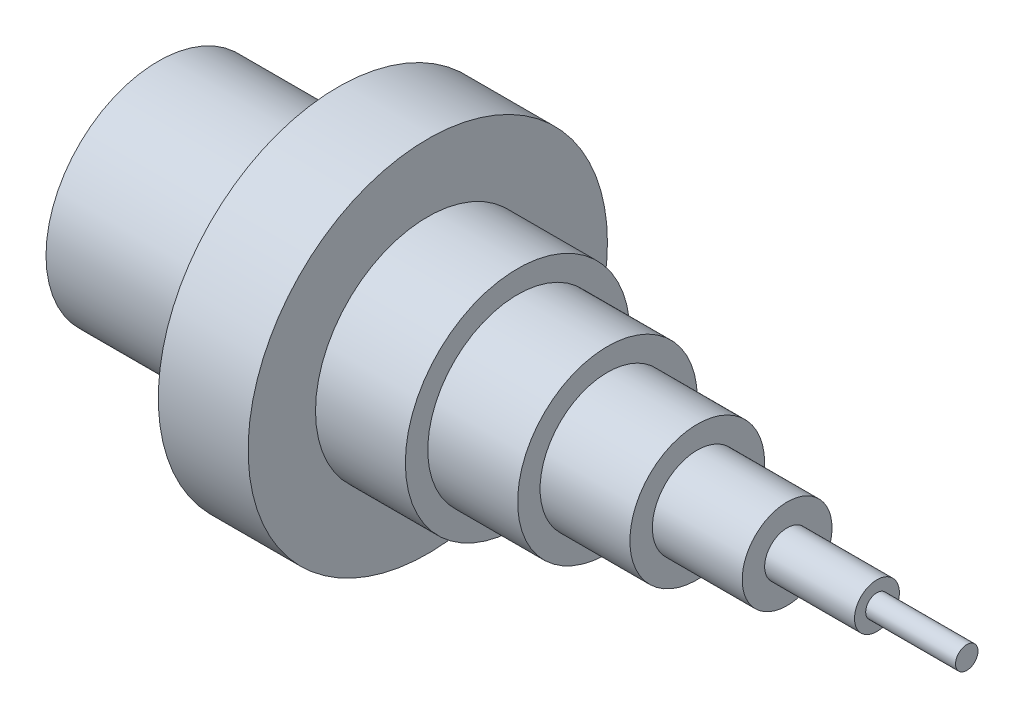
ISO-10303-21;
HEADER;
FILE_DESCRIPTION(('STEP AP214'),'2;1');
FILE_NAME('part.step','',(''),(''),'','','');
FILE_SCHEMA(('AUTOMOTIVE_DESIGN { 1 0 10303 214 1 1 1 1 }'));
ENDSEC;
DATA;
#1=APPLICATION_CONTEXT('core data for automotive mechanical design processes');
#2=APPLICATION_PROTOCOL_DEFINITION('international standard','automotive_design',2000,#1);
#3=PRODUCT_CONTEXT('',#1,'mechanical');
#4=PRODUCT('Part','Part','',(#3));
#5=PRODUCT_RELATED_PRODUCT_CATEGORY('part','',(#4));
#6=PRODUCT_DEFINITION_FORMATION('','',#4);
#7=PRODUCT_DEFINITION_CONTEXT('part definition',#1,'design');
#8=PRODUCT_DEFINITION('design','',#6,#7);
#9=PRODUCT_DEFINITION_SHAPE('','',#8);
#10=(LENGTH_UNIT() NAMED_UNIT(*) SI_UNIT(.MILLI.,.METRE.));
#11=(NAMED_UNIT(*) PLANE_ANGLE_UNIT() SI_UNIT($,.RADIAN.));
#12=(NAMED_UNIT(*) SI_UNIT($,.STERADIAN.) SOLID_ANGLE_UNIT());
#13=UNCERTAINTY_MEASURE_WITH_UNIT(LENGTH_MEASURE(1.E-05),#10,'distance_accuracy_value','');
#14=(GEOMETRIC_REPRESENTATION_CONTEXT(3) GLOBAL_UNCERTAINTY_ASSIGNED_CONTEXT((#13)) GLOBAL_UNIT_ASSIGNED_CONTEXT((#10,
#11,#12)) REPRESENTATION_CONTEXT('',''));
#15=CARTESIAN_POINT('',(0.,0.,0.));
#16=DIRECTION('',(0.,0.,1.));
#17=DIRECTION('',(1.,0.,0.));
#18=AXIS2_PLACEMENT_3D('',#15,#16,#17);
#19=CARTESIAN_POINT('',(180.,0.,0.));
#20=DIRECTION('',(-1.,0.,0.));
#21=DIRECTION('',(0.,0.,1.));
#22=AXIS2_PLACEMENT_3D('',#19,#20,#21);
#23=CYLINDRICAL_SURFACE('',#22,2.5);
#24=CARTESIAN_POINT('',(180.,0.,0.));
#25=DIRECTION('',(1.,0.,0.));
#26=DIRECTION('',(0.,0.,-1.));
#27=AXIS2_PLACEMENT_3D('',#24,#25,#26);
#28=CIRCLE('',#27,2.5);
#29=CARTESIAN_POINT('',(180.,0.,-2.5));
#30=VERTEX_POINT('',#29);
#31=EDGE_CURVE('E10',#30,#30,#28,.T.);
#32=ORIENTED_EDGE('',*,*,#31,.F.);
#33=EDGE_LOOP('',(#32));
#34=FACE_BOUND('',#33,.T.);
#35=CARTESIAN_POINT('',(160.,0.,0.));
#36=DIRECTION('',(1.,0.,0.));
#37=DIRECTION('',(0.,0.,-1.));
#38=AXIS2_PLACEMENT_3D('',#35,#36,#37);
#39=CIRCLE('',#38,2.5);
#40=CARTESIAN_POINT('',(160.,0.,-2.5));
#41=VERTEX_POINT('',#40);
#42=EDGE_CURVE('E33',#41,#41,#39,.T.);
#43=ORIENTED_EDGE('',*,*,#42,.T.);
#44=EDGE_LOOP('',(#43));
#45=FACE_BOUND('',#44,.T.);
#46=ADVANCED_FACE('F30',(#34,#45),#23,.T.);
#47=CARTESIAN_POINT('',(180.,0.,0.));
#48=DIRECTION('',(1.,0.,0.));
#49=DIRECTION('',(0.,0.,-1.));
#50=AXIS2_PLACEMENT_3D('',#47,#48,#49);
#51=PLANE('',#50);
#52=ORIENTED_EDGE('',*,*,#31,.T.);
#53=EDGE_LOOP('',(#52));
#54=FACE_BOUND('',#53,.T.);
#55=ADVANCED_FACE('F161',(#54),#51,.T.);
#56=CARTESIAN_POINT('',(160.,0.,0.));
#57=DIRECTION('',(-1.,0.,0.));
#58=DIRECTION('',(0.,0.,1.));
#59=AXIS2_PLACEMENT_3D('',#56,#57,#58);
#60=CYLINDRICAL_SURFACE('',#59,5.);
#61=CARTESIAN_POINT('',(160.,0.,0.));
#62=DIRECTION('',(1.,0.,0.));
#63=DIRECTION('',(0.,0.,-1.));
#64=AXIS2_PLACEMENT_3D('',#61,#62,#63);
#65=CIRCLE('',#64,5.);
#66=CARTESIAN_POINT('',(160.,0.,-5.));
#67=VERTEX_POINT('',#66);
#68=EDGE_CURVE('E40',#67,#67,#65,.T.);
#69=ORIENTED_EDGE('',*,*,#68,.F.);
#70=EDGE_LOOP('',(#69));
#71=FACE_BOUND('',#70,.T.);
#72=CARTESIAN_POINT('',(140.,0.,0.));
#73=DIRECTION('',(1.,0.,0.));
#74=DIRECTION('',(0.,0.,-1.));
#75=AXIS2_PLACEMENT_3D('',#72,#73,#74);
#76=CIRCLE('',#75,5.);
#77=CARTESIAN_POINT('',(140.,0.,-5.));
#78=VERTEX_POINT('',#77);
#79=EDGE_CURVE('E42',#78,#78,#76,.T.);
#80=ORIENTED_EDGE('',*,*,#79,.T.);
#81=EDGE_LOOP('',(#80));
#82=FACE_BOUND('',#81,.T.);
#83=ADVANCED_FACE('F166',(#71,#82),#60,.T.);
#84=CARTESIAN_POINT('',(160.,0.,0.));
#85=DIRECTION('',(1.,0.,0.));
#86=DIRECTION('',(0.,0.,-1.));
#87=AXIS2_PLACEMENT_3D('',#84,#85,#86);
#88=PLANE('',#87);
#89=ORIENTED_EDGE('',*,*,#42,.F.);
#90=EDGE_LOOP('',(#89));
#91=FACE_BOUND('',#90,.T.);
#92=ORIENTED_EDGE('',*,*,#68,.T.);
#93=EDGE_LOOP('',(#92));
#94=FACE_BOUND('',#93,.T.);
#95=ADVANCED_FACE('F170',(#91,#94),#88,.T.);
#96=CARTESIAN_POINT('',(40.,0.,0.));
#97=DIRECTION('',(-1.,0.,0.));
#98=DIRECTION('',(0.,0.,1.));
#99=AXIS2_PLACEMENT_3D('',#96,#97,#98);
#100=CYLINDRICAL_SURFACE('',#99,25.);
#101=CARTESIAN_POINT('',(40.,0.,0.));
#102=DIRECTION('',(1.,0.,0.));
#103=DIRECTION('',(0.,0.,-1.));
#104=AXIS2_PLACEMENT_3D('',#101,#102,#103);
#105=CIRCLE('',#104,25.);
#106=CARTESIAN_POINT('',(40.,0.,-25.));
#107=VERTEX_POINT('',#106);
#108=EDGE_CURVE('E51',#107,#107,#105,.T.);
#109=ORIENTED_EDGE('',*,*,#108,.F.);
#110=EDGE_LOOP('',(#109));
#111=FACE_BOUND('',#110,.T.);
#112=CARTESIAN_POINT('',(0.,0.,0.));
#113=DIRECTION('',(1.,0.,0.));
#114=DIRECTION('',(0.,0.,-1.));
#115=AXIS2_PLACEMENT_3D('',#112,#113,#114);
#116=CIRCLE('',#115,25.);
#117=CARTESIAN_POINT('',(0.,0.,-25.));
#118=VERTEX_POINT('',#117);
#119=EDGE_CURVE('E48',#118,#118,#116,.T.);
#120=ORIENTED_EDGE('',*,*,#119,.T.);
#121=EDGE_LOOP('',(#120));
#122=FACE_BOUND('',#121,.T.);
#123=ADVANCED_FACE('F173',(#111,#122),#100,.T.);
#124=CARTESIAN_POINT('',(0.,0.,0.));
#125=DIRECTION('',(1.,0.,0.));
#126=DIRECTION('',(0.,0.,-1.));
#127=AXIS2_PLACEMENT_3D('',#124,#125,#126);
#128=PLANE('',#127);
#129=CARTESIAN_POINT('',(0.,0.,0.));
#130=DIRECTION('',(1.,0.,0.));
#131=DIRECTION('',(0.,0.,-1.));
#132=AXIS2_PLACEMENT_3D('',#129,#130,#131);
#133=CIRCLE('',#132,20.);
#134=CARTESIAN_POINT('',(0.,0.,-20.));
#135=VERTEX_POINT('',#134);
#136=EDGE_CURVE('E58',#135,#135,#133,.T.);
#137=ORIENTED_EDGE('',*,*,#136,.T.);
#138=EDGE_LOOP('',(#137));
#139=FACE_BOUND('',#138,.T.);
#140=ORIENTED_EDGE('',*,*,#119,.F.);
#141=EDGE_LOOP('',(#140));
#142=FACE_BOUND('',#141,.T.);
#143=ADVANCED_FACE('F155',(#139,#142),#128,.F.);
#144=CARTESIAN_POINT('',(70.,0.,0.));
#145=DIRECTION('',(-1.,0.,0.));
#146=DIRECTION('',(0.,0.,1.));
#147=AXIS2_PLACEMENT_3D('',#144,#145,#146);
#148=CYLINDRICAL_SURFACE('',#147,20.);
#149=CARTESIAN_POINT('',(40.,0.,0.));
#150=DIRECTION('',(1.,0.,0.));
#151=DIRECTION('',(0.,0.,-1.));
#152=AXIS2_PLACEMENT_3D('',#149,#150,#151);
#153=CIRCLE('',#152,20.);
#154=CARTESIAN_POINT('',(40.,0.,-20.));
#155=VERTEX_POINT('',#154);
#156=EDGE_CURVE('E52',#155,#155,#153,.F.);
#157=ORIENTED_EDGE('',*,*,#156,.F.);
#158=EDGE_LOOP('',(#157));
#159=FACE_BOUND('',#158,.T.);
#160=ORIENTED_EDGE('',*,*,#136,.F.);
#161=EDGE_LOOP('',(#160));
#162=FACE_BOUND('',#161,.T.);
#163=ADVANCED_FACE('F149',(#159,#162),#148,.F.);
#164=CARTESIAN_POINT('',(40.,0.,0.));
#165=DIRECTION('',(1.,0.,0.));
#166=DIRECTION('',(0.,0.,-1.));
#167=AXIS2_PLACEMENT_3D('',#164,#165,#166);
#168=PLANE('',#167);
#169=ORIENTED_EDGE('',*,*,#108,.T.);
#170=EDGE_LOOP('',(#169));
#171=FACE_BOUND('',#170,.T.);
#172=CARTESIAN_POINT('',(40.,0.,0.));
#173=DIRECTION('',(1.,0.,0.));
#174=DIRECTION('',(0.,0.,-1.));
#175=AXIS2_PLACEMENT_3D('',#172,#173,#174);
#176=CIRCLE('',#175,40.);
#177=CARTESIAN_POINT('',(40.,0.,-40.));
#178=VERTEX_POINT('',#177);
#179=EDGE_CURVE('E62',#178,#178,#176,.T.);
#180=ORIENTED_EDGE('',*,*,#179,.F.);
#181=EDGE_LOOP('',(#180));
#182=FACE_BOUND('',#181,.T.);
#183=ADVANCED_FACE('F139',(#171,#182),#168,.F.);
#184=CARTESIAN_POINT('',(60.,0.,0.));
#185=DIRECTION('',(1.,0.,0.));
#186=DIRECTION('',(0.,0.,-1.));
#187=AXIS2_PLACEMENT_3D('',#184,#185,#186);
#188=PLANE('',#187);
#189=CARTESIAN_POINT('',(60.,0.,0.));
#190=DIRECTION('',(1.,0.,0.));
#191=DIRECTION('',(0.,0.,-1.));
#192=AXIS2_PLACEMENT_3D('',#189,#190,#191);
#193=CIRCLE('',#192,25.);
#194=CARTESIAN_POINT('',(60.,0.,-25.));
#195=VERTEX_POINT('',#194);
#196=EDGE_CURVE('E55',#195,#195,#193,.T.);
#197=ORIENTED_EDGE('',*,*,#196,.F.);
#198=EDGE_LOOP('',(#197));
#199=FACE_BOUND('',#198,.T.);
#200=CARTESIAN_POINT('',(60.,0.,0.));
#201=DIRECTION('',(1.,0.,0.));
#202=DIRECTION('',(0.,0.,-1.));
#203=AXIS2_PLACEMENT_3D('',#200,#201,#202);
#204=CIRCLE('',#203,40.);
#205=CARTESIAN_POINT('',(60.,0.,-40.));
#206=VERTEX_POINT('',#205);
#207=EDGE_CURVE('E61',#206,#206,#204,.T.);
#208=ORIENTED_EDGE('',*,*,#207,.T.);
#209=EDGE_LOOP('',(#208));
#210=FACE_BOUND('',#209,.T.);
#211=ADVANCED_FACE('F135',(#199,#210),#188,.T.);
#212=CARTESIAN_POINT('',(60.,0.,0.));
#213=DIRECTION('',(-1.,0.,0.));
#214=DIRECTION('',(0.,0.,1.));
#215=AXIS2_PLACEMENT_3D('',#212,#213,#214);
#216=CYLINDRICAL_SURFACE('',#215,40.);
#217=ORIENTED_EDGE('',*,*,#207,.F.);
#218=EDGE_LOOP('',(#217));
#219=FACE_BOUND('',#218,.T.);
#220=ORIENTED_EDGE('',*,*,#179,.T.);
#221=EDGE_LOOP('',(#220));
#222=FACE_BOUND('',#221,.T.);
#223=ADVANCED_FACE('F138',(#219,#222),#216,.T.);
#224=ORIENTED_EDGE('',*,*,#156,.T.);
#225=EDGE_LOOP('',(#224));
#226=FACE_BOUND('',#225,.T.);
#227=ADVANCED_FACE('F131',(#226),#168,.F.);
#228=CARTESIAN_POINT('',(80.,0.,0.));
#229=DIRECTION('',(-1.,0.,0.));
#230=DIRECTION('',(0.,0.,1.));
#231=AXIS2_PLACEMENT_3D('',#228,#229,#230);
#232=CYLINDRICAL_SURFACE('',#231,25.);
#233=CARTESIAN_POINT('',(80.,0.,0.));
#234=DIRECTION('',(1.,0.,0.));
#235=DIRECTION('',(0.,0.,-1.));
#236=AXIS2_PLACEMENT_3D('',#233,#234,#235);
#237=CIRCLE('',#236,25.);
#238=CARTESIAN_POINT('',(80.,0.,-25.));
#239=VERTEX_POINT('',#238);
#240=EDGE_CURVE('E65',#239,#239,#237,.T.);
#241=ORIENTED_EDGE('',*,*,#240,.F.);
#242=EDGE_LOOP('',(#241));
#243=FACE_BOUND('',#242,.T.);
#244=ORIENTED_EDGE('',*,*,#196,.T.);
#245=EDGE_LOOP('',(#244));
#246=FACE_BOUND('',#245,.T.);
#247=ADVANCED_FACE('F125',(#243,#246),#232,.T.);
#248=CARTESIAN_POINT('',(80.,0.,0.));
#249=DIRECTION('',(1.,0.,0.));
#250=DIRECTION('',(0.,0.,-1.));
#251=AXIS2_PLACEMENT_3D('',#248,#249,#250);
#252=PLANE('',#251);
#253=CARTESIAN_POINT('',(80.,0.,0.));
#254=DIRECTION('',(1.,0.,0.));
#255=DIRECTION('',(0.,0.,-1.));
#256=AXIS2_PLACEMENT_3D('',#253,#254,#255);
#257=CIRCLE('',#256,20.);
#258=CARTESIAN_POINT('',(80.,0.,-20.));
#259=VERTEX_POINT('',#258);
#260=EDGE_CURVE('E70',#259,#259,#257,.T.);
#261=ORIENTED_EDGE('',*,*,#260,.F.);
#262=EDGE_LOOP('',(#261));
#263=FACE_BOUND('',#262,.T.);
#264=ORIENTED_EDGE('',*,*,#240,.T.);
#265=EDGE_LOOP('',(#264));
#266=FACE_BOUND('',#265,.T.);
#267=ADVANCED_FACE('F119',(#263,#266),#252,.T.);
#268=CARTESIAN_POINT('',(100.,0.,0.));
#269=DIRECTION('',(-1.,0.,0.));
#270=DIRECTION('',(0.,0.,1.));
#271=AXIS2_PLACEMENT_3D('',#268,#269,#270);
#272=CYLINDRICAL_SURFACE('',#271,20.);
#273=CARTESIAN_POINT('',(100.,0.,0.));
#274=DIRECTION('',(1.,0.,0.));
#275=DIRECTION('',(0.,0.,-1.));
#276=AXIS2_PLACEMENT_3D('',#273,#274,#275);
#277=CIRCLE('',#276,20.);
#278=CARTESIAN_POINT('',(100.,0.,-20.));
#279=VERTEX_POINT('',#278);
#280=EDGE_CURVE('E73',#279,#279,#277,.T.);
#281=ORIENTED_EDGE('',*,*,#280,.F.);
#282=EDGE_LOOP('',(#281));
#283=FACE_BOUND('',#282,.T.);
#284=ORIENTED_EDGE('',*,*,#260,.T.);
#285=EDGE_LOOP('',(#284));
#286=FACE_BOUND('',#285,.T.);
#287=ADVANCED_FACE('F113',(#283,#286),#272,.T.);
#288=CARTESIAN_POINT('',(100.,0.,0.));
#289=DIRECTION('',(1.,0.,0.));
#290=DIRECTION('',(0.,0.,-1.));
#291=AXIS2_PLACEMENT_3D('',#288,#289,#290);
#292=PLANE('',#291);
#293=CARTESIAN_POINT('',(100.,0.,0.));
#294=DIRECTION('',(1.,0.,0.));
#295=DIRECTION('',(0.,0.,-1.));
#296=AXIS2_PLACEMENT_3D('',#293,#294,#295);
#297=CIRCLE('',#296,15.);
#298=CARTESIAN_POINT('',(100.,0.,-15.));
#299=VERTEX_POINT('',#298);
#300=EDGE_CURVE('E76',#299,#299,#297,.T.);
#301=ORIENTED_EDGE('',*,*,#300,.F.);
#302=EDGE_LOOP('',(#301));
#303=FACE_BOUND('',#302,.T.);
#304=ORIENTED_EDGE('',*,*,#280,.T.);
#305=EDGE_LOOP('',(#304));
#306=FACE_BOUND('',#305,.T.);
#307=ADVANCED_FACE('F107',(#303,#306),#292,.T.);
#308=CARTESIAN_POINT('',(120.,0.,0.));
#309=DIRECTION('',(-1.,0.,0.));
#310=DIRECTION('',(0.,0.,1.));
#311=AXIS2_PLACEMENT_3D('',#308,#309,#310);
#312=CYLINDRICAL_SURFACE('',#311,15.);
#313=CARTESIAN_POINT('',(120.,0.,0.));
#314=DIRECTION('',(1.,0.,0.));
#315=DIRECTION('',(0.,0.,-1.));
#316=AXIS2_PLACEMENT_3D('',#313,#314,#315);
#317=CIRCLE('',#316,15.);
#318=CARTESIAN_POINT('',(120.,0.,-15.));
#319=VERTEX_POINT('',#318);
#320=EDGE_CURVE('E79',#319,#319,#317,.T.);
#321=ORIENTED_EDGE('',*,*,#320,.F.);
#322=EDGE_LOOP('',(#321));
#323=FACE_BOUND('',#322,.T.);
#324=ORIENTED_EDGE('',*,*,#300,.T.);
#325=EDGE_LOOP('',(#324));
#326=FACE_BOUND('',#325,.T.);
#327=ADVANCED_FACE('F101',(#323,#326),#312,.T.);
#328=CARTESIAN_POINT('',(120.,0.,0.));
#329=DIRECTION('',(1.,0.,0.));
#330=DIRECTION('',(0.,0.,-1.));
#331=AXIS2_PLACEMENT_3D('',#328,#329,#330);
#332=PLANE('',#331);
#333=CARTESIAN_POINT('',(120.,0.,0.));
#334=DIRECTION('',(1.,0.,0.));
#335=DIRECTION('',(0.,0.,-1.));
#336=AXIS2_PLACEMENT_3D('',#333,#334,#335);
#337=CIRCLE('',#336,10.);
#338=CARTESIAN_POINT('',(120.,0.,-10.));
#339=VERTEX_POINT('',#338);
#340=EDGE_CURVE('E45',#339,#339,#337,.T.);
#341=ORIENTED_EDGE('',*,*,#340,.F.);
#342=EDGE_LOOP('',(#341));
#343=FACE_BOUND('',#342,.T.);
#344=ORIENTED_EDGE('',*,*,#320,.T.);
#345=EDGE_LOOP('',(#344));
#346=FACE_BOUND('',#345,.T.);
#347=ADVANCED_FACE('F95',(#343,#346),#332,.T.);
#348=CARTESIAN_POINT('',(140.,0.,0.));
#349=DIRECTION('',(-1.,0.,0.));
#350=DIRECTION('',(0.,0.,1.));
#351=AXIS2_PLACEMENT_3D('',#348,#349,#350);
#352=CYLINDRICAL_SURFACE('',#351,10.);
#353=CARTESIAN_POINT('',(140.,0.,0.));
#354=DIRECTION('',(1.,0.,0.));
#355=DIRECTION('',(0.,0.,-1.));
#356=AXIS2_PLACEMENT_3D('',#353,#354,#355);
#357=CIRCLE('',#356,10.);
#358=CARTESIAN_POINT('',(140.,0.,-10.));
#359=VERTEX_POINT('',#358);
#360=EDGE_CURVE('E84',#359,#359,#357,.T.);
#361=ORIENTED_EDGE('',*,*,#360,.F.);
#362=EDGE_LOOP('',(#361));
#363=FACE_BOUND('',#362,.T.);
#364=ORIENTED_EDGE('',*,*,#340,.T.);
#365=EDGE_LOOP('',(#364));
#366=FACE_BOUND('',#365,.T.);
#367=ADVANCED_FACE('F92',(#363,#366),#352,.T.);
#368=CARTESIAN_POINT('',(140.,0.,0.));
#369=DIRECTION('',(1.,0.,0.));
#370=DIRECTION('',(0.,0.,-1.));
#371=AXIS2_PLACEMENT_3D('',#368,#369,#370);
#372=PLANE('',#371);
#373=ORIENTED_EDGE('',*,*,#79,.F.);
#374=EDGE_LOOP('',(#373));
#375=FACE_BOUND('',#374,.T.);
#376=ORIENTED_EDGE('',*,*,#360,.T.);
#377=EDGE_LOOP('',(#376));
#378=FACE_BOUND('',#377,.T.);
#379=ADVANCED_FACE('F90',(#375,#378),#372,.T.);
#380=CLOSED_SHELL('',(#46,#55,#83,#95,#123,#143,#163,#183,#211,#223,#227,#247,#267,#287,#307,
#327,#347,#367,#379));
#381=MANIFOLD_SOLID_BREP('B2',#380);
#382=ADVANCED_BREP_SHAPE_REPRESENTATION('',(#18,#381),#14);
#383=SHAPE_DEFINITION_REPRESENTATION(#9,#382);
ENDSEC;
END-ISO-10303-21;
